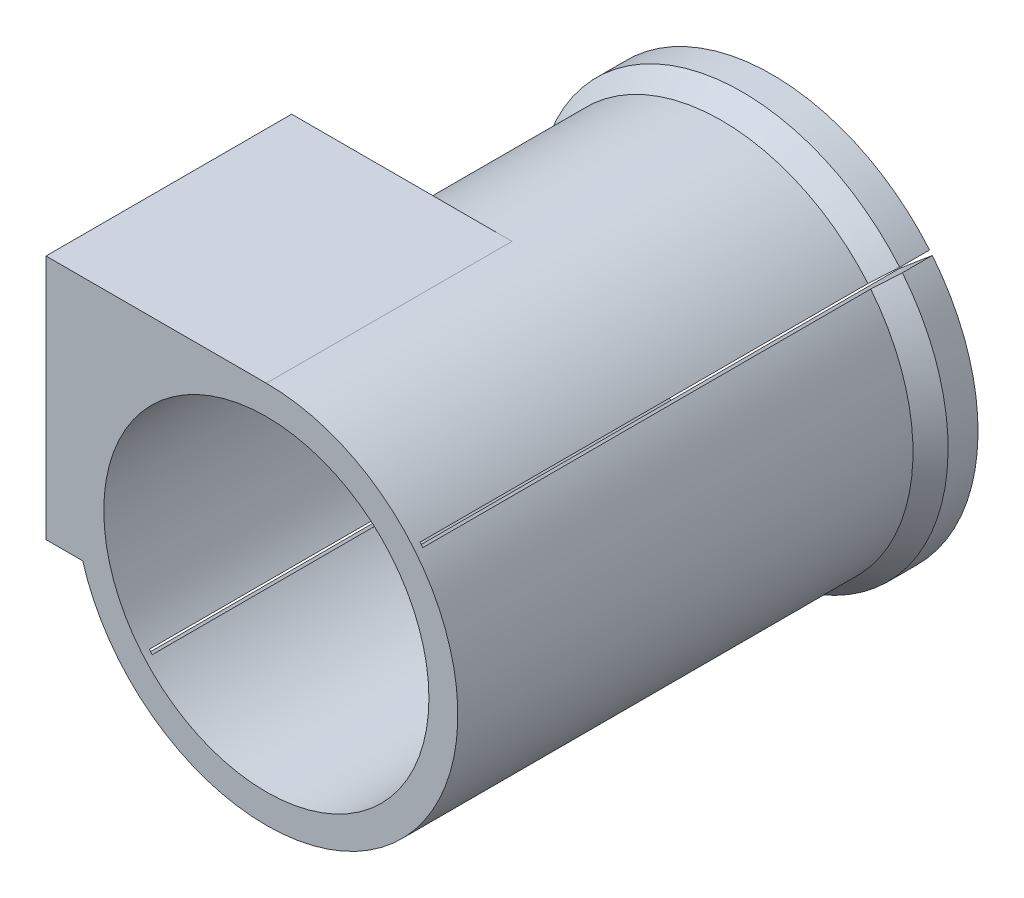
ISO-10303-21;
HEADER;
FILE_DESCRIPTION(('STEP AP214'),'2;1');
FILE_NAME('part.step','',(''),(''),'','','');
FILE_SCHEMA(('AUTOMOTIVE_DESIGN { 1 0 10303 214 1 1 1 1 }'));
ENDSEC;
DATA;
#1=APPLICATION_CONTEXT('core data for automotive mechanical design processes');
#2=APPLICATION_PROTOCOL_DEFINITION('international standard','automotive_design',2000,#1);
#3=PRODUCT_CONTEXT('',#1,'mechanical');
#4=PRODUCT('Part','Part','',(#3));
#5=PRODUCT_RELATED_PRODUCT_CATEGORY('part','',(#4));
#6=PRODUCT_DEFINITION_FORMATION('','',#4);
#7=PRODUCT_DEFINITION_CONTEXT('part definition',#1,'design');
#8=PRODUCT_DEFINITION('design','',#6,#7);
#9=PRODUCT_DEFINITION_SHAPE('','',#8);
#10=(LENGTH_UNIT() NAMED_UNIT(*) SI_UNIT(.MILLI.,.METRE.));
#11=(NAMED_UNIT(*) PLANE_ANGLE_UNIT() SI_UNIT($,.RADIAN.));
#12=(NAMED_UNIT(*) SI_UNIT($,.STERADIAN.) SOLID_ANGLE_UNIT());
#13=UNCERTAINTY_MEASURE_WITH_UNIT(LENGTH_MEASURE(1.E-05),#10,'distance_accuracy_value','');
#14=(GEOMETRIC_REPRESENTATION_CONTEXT(3) GLOBAL_UNCERTAINTY_ASSIGNED_CONTEXT((#13)) GLOBAL_UNIT_ASSIGNED_CONTEXT((#10,
#11,#12)) REPRESENTATION_CONTEXT('',''));
#15=CARTESIAN_POINT('',(0.,0.,0.));
#16=DIRECTION('',(0.,0.,1.));
#17=DIRECTION('',(1.,0.,0.));
#18=AXIS2_PLACEMENT_3D('',#15,#16,#17);
#19=CARTESIAN_POINT('',(0.,0.,0.));
#20=DIRECTION('',(0.,0.,1.));
#21=DIRECTION('',(1.,0.,0.));
#22=AXIS2_PLACEMENT_3D('',#19,#20,#21);
#23=PLANE('',#22);
#24=CARTESIAN_POINT('',(0.,0.,0.));
#25=DIRECTION('',(0.,0.,-1.));
#26=DIRECTION('',(-1.,0.,0.));
#27=AXIS2_PLACEMENT_3D('',#24,#25,#26);
#28=CIRCLE('',#27,14.25);
#29=CARTESIAN_POINT('',(-10.8967622003917,-9.18275958239758,0.));
#30=VERTEX_POINT('',#29);
#31=CARTESIAN_POINT('',(10.8967622003917,9.18275958239759,0.));
#32=VERTEX_POINT('',#31);
#33=EDGE_CURVE('E181',#30,#32,#28,.T.);
#34=ORIENTED_EDGE('',*,*,#33,.T.);
#35=DIRECTION('',(0.764685066694154,0.644404181220883,0.));
#36=VECTOR('',#35,1.);
#37=CARTESIAN_POINT('',(-20.9303446225494,-17.6381129652155,0.));
#38=LINE('',#37,#36);
#39=CARTESIAN_POINT('',(8.60270700030923,7.24954703873494,0.));
#40=VERTEX_POINT('',#39);
#41=EDGE_CURVE('E329',#40,#32,#38,.T.);
#42=ORIENTED_EDGE('',*,*,#41,.F.);
#43=CARTESIAN_POINT('',(0.,0.,0.));
#44=DIRECTION('',(0.,0.,1.));
#45=DIRECTION('',(1.,0.,0.));
#46=AXIS2_PLACEMENT_3D('',#43,#44,#45);
#47=CIRCLE('',#46,11.25);
#48=CARTESIAN_POINT('',(-8.60270700030924,-7.24954703873493,0.));
#49=VERTEX_POINT('',#48);
#50=EDGE_CURVE('E232',#40,#49,#47,.T.);
#51=ORIENTED_EDGE('',*,*,#50,.T.);
#52=EDGE_CURVE('E331',#30,#49,#38,.T.);
#53=ORIENTED_EDGE('',*,*,#52,.F.);
#54=EDGE_LOOP('',(#34,#42,#51,#53));
#55=FACE_BOUND('',#54,.T.);
#56=ADVANCED_FACE('F40',(#55),#23,.F.);
#57=CARTESIAN_POINT('',(0.,0.,2.));
#58=DIRECTION('',(0.,0.,-1.));
#59=DIRECTION('',(-1.,0.,0.));
#60=AXIS2_PLACEMENT_3D('',#57,#58,#59);
#61=CYLINDRICAL_SURFACE('',#60,14.25);
#62=DIRECTION('',(0.,0.,-1.));
#63=VECTOR('',#62,1.);
#64=CARTESIAN_POINT('',(10.8967622003917,9.18275958239759,2.));
#65=LINE('',#64,#63);
#66=CARTESIAN_POINT('',(10.8967622003917,9.18275958239759,2.07185199325792));
#67=VERTEX_POINT('',#66);
#68=EDGE_CURVE('E334',#32,#67,#65,.F.);
#69=ORIENTED_EDGE('',*,*,#68,.F.);
#70=ORIENTED_EDGE('',*,*,#33,.F.);
#71=DIRECTION('',(0.,0.,-1.));
#72=VECTOR('',#71,1.);
#73=CARTESIAN_POINT('',(-10.8967622003917,-9.18275958239758,2.));
#74=LINE('',#73,#72);
#75=CARTESIAN_POINT('',(-10.8967622003917,-9.18275958239758,2.07185199325792));
#76=VERTEX_POINT('',#75);
#77=EDGE_CURVE('E333',#76,#30,#74,.T.);
#78=ORIENTED_EDGE('',*,*,#77,.F.);
#79=CARTESIAN_POINT('',(0.,0.,2.07185199325792));
#80=DIRECTION('',(0.,0.,-1.));
#81=DIRECTION('',(-1.,0.,0.));
#82=AXIS2_PLACEMENT_3D('',#79,#80,#81);
#83=CIRCLE('',#82,14.25);
#84=EDGE_CURVE('E251',#76,#67,#83,.T.);
#85=ORIENTED_EDGE('',*,*,#84,.T.);
#86=EDGE_LOOP('',(#69,#70,#78,#85));
#87=FACE_BOUND('',#86,.T.);
#88=ADVANCED_FACE('F282',(#87),#61,.T.);
#89=CARTESIAN_POINT('',(0.,0.,35.));
#90=DIRECTION('',(0.,0.,-1.));
#91=DIRECTION('',(-1.,0.,0.));
#92=AXIS2_PLACEMENT_3D('',#89,#90,#91);
#93=CYLINDRICAL_SURFACE('',#92,13.25);
#94=DIRECTION('',(0.,0.,-1.));
#95=VECTOR('',#94,1.);
#96=CARTESIAN_POINT('',(10.1320771336975,8.53835540117671,35.));
#97=LINE('',#96,#95);
#98=CARTESIAN_POINT('',(10.1320771336975,8.5383554011767,34.5));
#99=VERTEX_POINT('',#98);
#100=CARTESIAN_POINT('',(10.1320771336975,8.53835540117671,3.50000000000001));
#101=VERTEX_POINT('',#100);
#102=EDGE_CURVE('E339',#99,#101,#97,.T.);
#103=ORIENTED_EDGE('',*,*,#102,.T.);
#104=CARTESIAN_POINT('',(0.,0.,3.50000000000001));
#105=DIRECTION('',(0.,0.,-1.));
#106=DIRECTION('',(-1.,0.,0.));
#107=AXIS2_PLACEMENT_3D('',#104,#105,#106);
#108=CIRCLE('',#107,13.25);
#109=CARTESIAN_POINT('',(-10.1320771336975,-8.5383554011767,3.50000000000001));
#110=VERTEX_POINT('',#109);
#111=EDGE_CURVE('E247',#101,#110,#108,.F.);
#112=ORIENTED_EDGE('',*,*,#111,.T.);
#113=DIRECTION('',(0.,0.,-1.));
#114=VECTOR('',#113,1.);
#115=CARTESIAN_POINT('',(-10.1320771336975,-8.5383554011767,35.));
#116=LINE('',#115,#114);
#117=CARTESIAN_POINT('',(-10.1320771336975,-8.5383554011767,34.5));
#118=VERTEX_POINT('',#117);
#119=EDGE_CURVE('E352',#110,#118,#116,.F.);
#120=ORIENTED_EDGE('',*,*,#119,.T.);
#121=CARTESIAN_POINT('',(0.,0.,34.5));
#122=DIRECTION('',(0.,0.,-1.));
#123=DIRECTION('',(-1.,0.,0.));
#124=AXIS2_PLACEMENT_3D('',#121,#122,#123);
#125=CIRCLE('',#124,13.25);
#126=CARTESIAN_POINT('',(-9.93615850278743,-8.76557209812829,34.5));
#127=VERTEX_POINT('',#126);
#128=EDGE_CURVE('E191',#127,#118,#125,.T.);
#129=ORIENTED_EDGE('',*,*,#128,.F.);
#130=DIRECTION('',(0.,0.,-1.));
#131=VECTOR('',#130,1.);
#132=CARTESIAN_POINT('',(-9.93615850278742,-8.76557209812829,35.));
#133=LINE('',#132,#131);
#134=CARTESIAN_POINT('',(-9.93615850278742,-8.76557209812829,3.50000000000001));
#135=VERTEX_POINT('',#134);
#136=EDGE_CURVE('E165',#127,#135,#133,.T.);
#137=ORIENTED_EDGE('',*,*,#136,.T.);
#138=CARTESIAN_POINT('',(0.,0.,3.50000000000001));
#139=DIRECTION('',(0.,0.,-1.));
#140=DIRECTION('',(-1.,0.,0.));
#141=AXIS2_PLACEMENT_3D('',#138,#139,#140);
#142=CIRCLE('',#141,13.25);
#143=CARTESIAN_POINT('',(10.32280101152,8.30676105811179,3.50000000000001));
#144=VERTEX_POINT('',#143);
#145=EDGE_CURVE('E243',#135,#144,#142,.F.);
#146=ORIENTED_EDGE('',*,*,#145,.T.);
#147=DIRECTION('',(0.,0.,-1.));
#148=VECTOR('',#147,1.);
#149=CARTESIAN_POINT('',(10.32280101152,8.30676105811179,35.));
#150=LINE('',#149,#148);
#151=CARTESIAN_POINT('',(10.32280101152,8.3067610581118,34.5));
#152=VERTEX_POINT('',#151);
#153=EDGE_CURVE('E164',#144,#152,#150,.F.);
#154=ORIENTED_EDGE('',*,*,#153,.T.);
#155=EDGE_CURVE('E188',#99,#152,#125,.T.);
#156=ORIENTED_EDGE('',*,*,#155,.F.);
#157=EDGE_LOOP('',(#103,#112,#120,#129,#137,#146,#154,#156));
#158=FACE_BOUND('',#157,.T.);
#159=DIRECTION('',(0.,0.,1.));
#160=VECTOR('',#159,1.);
#161=CARTESIAN_POINT('',(0.,13.25,18.));
#162=LINE('',#161,#160);
#163=CARTESIAN_POINT('',(0.,13.25,18.));
#164=VERTEX_POINT('',#163);
#165=CARTESIAN_POINT('',(0.,13.25,35.));
#166=VERTEX_POINT('',#165);
#167=EDGE_CURVE('E214',#164,#166,#162,.T.);
#168=ORIENTED_EDGE('',*,*,#167,.T.);
#169=CARTESIAN_POINT('',(0.,0.,35.));
#170=DIRECTION('',(0.,0.,1.));
#171=DIRECTION('',(1.,0.,0.));
#172=AXIS2_PLACEMENT_3D('',#169,#170,#171);
#173=CIRCLE('',#172,13.25);
#174=CARTESIAN_POINT('',(-12.7082650271388,-3.75,35.));
#175=VERTEX_POINT('',#174);
#176=EDGE_CURVE('E231',#175,#166,#173,.T.);
#177=ORIENTED_EDGE('',*,*,#176,.F.);
#178=DIRECTION('',(0.,0.,1.));
#179=VECTOR('',#178,1.);
#180=CARTESIAN_POINT('',(-12.7082650271388,-3.75,18.));
#181=LINE('',#180,#179);
#182=CARTESIAN_POINT('',(-12.7082650271388,-3.75,18.));
#183=VERTEX_POINT('',#182);
#184=EDGE_CURVE('E218',#183,#175,#181,.T.);
#185=ORIENTED_EDGE('',*,*,#184,.F.);
#186=CARTESIAN_POINT('',(0.,0.,18.));
#187=DIRECTION('',(0.,0.,1.));
#188=DIRECTION('',(1.,0.,0.));
#189=AXIS2_PLACEMENT_3D('',#186,#187,#188);
#190=CIRCLE('',#189,13.25);
#191=EDGE_CURVE('E205',#164,#183,#190,.T.);
#192=ORIENTED_EDGE('',*,*,#191,.F.);
#193=EDGE_LOOP('',(#168,#177,#185,#192));
#194=FACE_BOUND('',#193,.T.);
#195=ADVANCED_FACE('F305',(#158,#194),#93,.T.);
#196=CARTESIAN_POINT('',(0.,0.,35.));
#197=DIRECTION('',(0.,0.,1.));
#198=DIRECTION('',(1.,0.,0.));
#199=AXIS2_PLACEMENT_3D('',#196,#197,#198);
#200=PLANE('',#199);
#201=ORIENTED_EDGE('',*,*,#176,.T.);
#202=DIRECTION('',(1.,0.,0.));
#203=VECTOR('',#202,1.);
#204=CARTESIAN_POINT('',(0.,13.25,35.));
#205=LINE('',#204,#203);
#206=CARTESIAN_POINT('',(-15.25,13.25,35.));
#207=VERTEX_POINT('',#206);
#208=EDGE_CURVE('E180',#207,#166,#205,.T.);
#209=ORIENTED_EDGE('',*,*,#208,.F.);
#210=DIRECTION('',(0.,-1.,0.));
#211=VECTOR('',#210,1.);
#212=CARTESIAN_POINT('',(-15.25,0.,35.));
#213=LINE('',#212,#211);
#214=CARTESIAN_POINT('',(-15.25,-3.75,35.));
#215=VERTEX_POINT('',#214);
#216=EDGE_CURVE('E185',#207,#215,#213,.T.);
#217=ORIENTED_EDGE('',*,*,#216,.T.);
#218=DIRECTION('',(1.,0.,0.));
#219=VECTOR('',#218,1.);
#220=CARTESIAN_POINT('',(0.,-3.75,35.));
#221=LINE('',#220,#219);
#222=EDGE_CURVE('E197',#215,#175,#221,.T.);
#223=ORIENTED_EDGE('',*,*,#222,.T.);
#224=EDGE_LOOP('',(#201,#209,#217,#223));
#225=FACE_BOUND('',#224,.T.);
#226=CARTESIAN_POINT('',(0.,0.,35.));
#227=DIRECTION('',(0.,0.,1.));
#228=DIRECTION('',(1.,0.,0.));
#229=AXIS2_PLACEMENT_3D('',#226,#227,#228);
#230=CIRCLE('',#229,11.25);
#231=CARTESIAN_POINT('',(11.25,0.,35.));
#232=VERTEX_POINT('',#231);
#233=EDGE_CURVE('E227',#232,#232,#230,.T.);
#234=ORIENTED_EDGE('',*,*,#233,.F.);
#235=EDGE_LOOP('',(#234));
#236=FACE_BOUND('',#235,.T.);
#237=ADVANCED_FACE('F302',(#225,#236),#200,.T.);
#238=CARTESIAN_POINT('',(11.0876683921839,8.95131887628668,0.));
#239=VERTEX_POINT('',#238);
#240=CARTESIAN_POINT('',(-10.7010258834514,-9.41012991630318,0.));
#241=VERTEX_POINT('',#240);
#242=EDGE_CURVE('E172',#239,#241,#28,.T.);
#243=ORIENTED_EDGE('',*,*,#242,.T.);
#244=DIRECTION('',(-0.764685066694154,-0.644404181220883,0.));
#245=VECTOR('',#244,1.);
#246=CARTESIAN_POINT('',(21.1236658769157,17.4087074452073,0.));
#247=LINE('',#246,#245);
#248=CARTESIAN_POINT('',(-8.40632646170671,-7.47637448361232,0.));
#249=VERTEX_POINT('',#248);
#250=EDGE_CURVE('E176',#249,#241,#247,.T.);
#251=ORIENTED_EDGE('',*,*,#250,.F.);
#252=CARTESIAN_POINT('',(8.79296897043925,7.01756344359582,0.));
#253=VERTEX_POINT('',#252);
#254=EDGE_CURVE('E174',#249,#253,#47,.T.);
#255=ORIENTED_EDGE('',*,*,#254,.T.);
#256=EDGE_CURVE('E159',#239,#253,#247,.T.);
#257=ORIENTED_EDGE('',*,*,#256,.F.);
#258=EDGE_LOOP('',(#243,#251,#255,#257));
#259=FACE_BOUND('',#258,.T.);
#260=ADVANCED_FACE('F170',(#259),#23,.F.);
#261=CARTESIAN_POINT('',(0.,0.,35.));
#262=DIRECTION('',(0.,0.,-1.));
#263=DIRECTION('',(-1.,0.,0.));
#264=AXIS2_PLACEMENT_3D('',#261,#262,#263);
#265=CYLINDRICAL_SURFACE('',#264,11.25);
#266=DIRECTION('',(0.,0.,-1.));
#267=VECTOR('',#266,1.);
#268=CARTESIAN_POINT('',(8.60270700030923,7.24954703873494,35.));
#269=LINE('',#268,#267);
#270=CARTESIAN_POINT('',(8.60270700030923,7.24954703873494,34.5));
#271=VERTEX_POINT('',#270);
#272=EDGE_CURVE('E357',#271,#40,#269,.T.);
#273=ORIENTED_EDGE('',*,*,#272,.F.);
#274=CARTESIAN_POINT('',(0.,0.,34.5));
#275=DIRECTION('',(0.,0.,-1.));
#276=DIRECTION('',(-1.,0.,0.));
#277=AXIS2_PLACEMENT_3D('',#274,#275,#276);
#278=CIRCLE('',#277,11.25);
#279=CARTESIAN_POINT('',(8.79296897043925,7.01756344359583,34.5));
#280=VERTEX_POINT('',#279);
#281=EDGE_CURVE('E242',#271,#280,#278,.T.);
#282=ORIENTED_EDGE('',*,*,#281,.T.);
#283=DIRECTION('',(0.,0.,-1.));
#284=VECTOR('',#283,1.);
#285=CARTESIAN_POINT('',(8.79296897043925,7.01756344359582,35.));
#286=LINE('',#285,#284);
#287=EDGE_CURVE('E346',#253,#280,#286,.F.);
#288=ORIENTED_EDGE('',*,*,#287,.F.);
#289=ORIENTED_EDGE('',*,*,#254,.F.);
#290=DIRECTION('',(0.,0.,-1.));
#291=VECTOR('',#290,1.);
#292=CARTESIAN_POINT('',(-8.40632646170671,-7.47637448361232,35.));
#293=LINE('',#292,#291);
#294=CARTESIAN_POINT('',(-8.40632646170672,-7.47637448361232,34.5));
#295=VERTEX_POINT('',#294);
#296=EDGE_CURVE('E340',#295,#249,#293,.T.);
#297=ORIENTED_EDGE('',*,*,#296,.F.);
#298=CARTESIAN_POINT('',(-8.60270700030924,-7.24954703873493,34.5));
#299=VERTEX_POINT('',#298);
#300=EDGE_CURVE('E238',#295,#299,#278,.T.);
#301=ORIENTED_EDGE('',*,*,#300,.T.);
#302=DIRECTION('',(0.,0.,-1.));
#303=VECTOR('',#302,1.);
#304=CARTESIAN_POINT('',(-8.60270700030923,-7.24954703873493,35.));
#305=LINE('',#304,#303);
#306=EDGE_CURVE('E355',#49,#299,#305,.F.);
#307=ORIENTED_EDGE('',*,*,#306,.F.);
#308=ORIENTED_EDGE('',*,*,#50,.F.);
#309=EDGE_LOOP('',(#273,#282,#288,#289,#297,#301,#307,#308));
#310=FACE_BOUND('',#309,.T.);
#311=ORIENTED_EDGE('',*,*,#233,.T.);
#312=EDGE_LOOP('',(#311));
#313=FACE_BOUND('',#312,.T.);
#314=ADVANCED_FACE('F297',(#310,#313),#265,.F.);
#315=CARTESIAN_POINT('',(0.,13.25,18.));
#316=DIRECTION('',(0.,-1.,0.));
#317=DIRECTION('',(0.,0.,-1.));
#318=AXIS2_PLACEMENT_3D('',#315,#316,#317);
#319=PLANE('',#318);
#320=ORIENTED_EDGE('',*,*,#208,.T.);
#321=ORIENTED_EDGE('',*,*,#167,.F.);
#322=DIRECTION('',(1.,0.,0.));
#323=VECTOR('',#322,1.);
#324=CARTESIAN_POINT('',(0.,13.25,18.));
#325=LINE('',#324,#323);
#326=CARTESIAN_POINT('',(-15.25,13.25,18.));
#327=VERTEX_POINT('',#326);
#328=EDGE_CURVE('E193',#327,#164,#325,.T.);
#329=ORIENTED_EDGE('',*,*,#328,.F.);
#330=DIRECTION('',(0.,0.,1.));
#331=VECTOR('',#330,1.);
#332=CARTESIAN_POINT('',(-15.25,13.25,18.));
#333=LINE('',#332,#331);
#334=EDGE_CURVE('E207',#327,#207,#333,.T.);
#335=ORIENTED_EDGE('',*,*,#334,.T.);
#336=EDGE_LOOP('',(#320,#321,#329,#335));
#337=FACE_BOUND('',#336,.T.);
#338=ADVANCED_FACE('F290',(#337),#319,.F.);
#339=CARTESIAN_POINT('',(0.,-3.75,18.));
#340=DIRECTION('',(0.,-1.,0.));
#341=DIRECTION('',(0.,0.,-1.));
#342=AXIS2_PLACEMENT_3D('',#339,#340,#341);
#343=PLANE('',#342);
#344=ORIENTED_EDGE('',*,*,#222,.F.);
#345=DIRECTION('',(0.,0.,1.));
#346=VECTOR('',#345,1.);
#347=CARTESIAN_POINT('',(-15.25,-3.75,18.));
#348=LINE('',#347,#346);
#349=CARTESIAN_POINT('',(-15.25,-3.75,18.));
#350=VERTEX_POINT('',#349);
#351=EDGE_CURVE('E222',#350,#215,#348,.T.);
#352=ORIENTED_EDGE('',*,*,#351,.F.);
#353=DIRECTION('',(1.,0.,0.));
#354=VECTOR('',#353,1.);
#355=CARTESIAN_POINT('',(0.,-3.75,18.));
#356=LINE('',#355,#354);
#357=EDGE_CURVE('E201',#350,#183,#356,.T.);
#358=ORIENTED_EDGE('',*,*,#357,.T.);
#359=ORIENTED_EDGE('',*,*,#184,.T.);
#360=EDGE_LOOP('',(#344,#352,#358,#359));
#361=FACE_BOUND('',#360,.T.);
#362=ADVANCED_FACE('F287',(#361),#343,.T.);
#363=CARTESIAN_POINT('',(-15.25,0.,18.));
#364=DIRECTION('',(-1.,0.,0.));
#365=DIRECTION('',(0.,-1.,0.));
#366=AXIS2_PLACEMENT_3D('',#363,#364,#365);
#367=PLANE('',#366);
#368=ORIENTED_EDGE('',*,*,#216,.F.);
#369=ORIENTED_EDGE('',*,*,#334,.F.);
#370=DIRECTION('',(0.,-1.,0.));
#371=VECTOR('',#370,1.);
#372=CARTESIAN_POINT('',(-15.25,0.,18.));
#373=LINE('',#372,#371);
#374=EDGE_CURVE('E196',#327,#350,#373,.T.);
#375=ORIENTED_EDGE('',*,*,#374,.T.);
#376=ORIENTED_EDGE('',*,*,#351,.T.);
#377=EDGE_LOOP('',(#368,#369,#375,#376));
#378=FACE_BOUND('',#377,.T.);
#379=ADVANCED_FACE('F285',(#378),#367,.T.);
#380=CARTESIAN_POINT('',(0.,0.,18.));
#381=DIRECTION('',(0.,0.,1.));
#382=DIRECTION('',(1.,0.,0.));
#383=AXIS2_PLACEMENT_3D('',#380,#381,#382);
#384=PLANE('',#383);
#385=ORIENTED_EDGE('',*,*,#328,.T.);
#386=ORIENTED_EDGE('',*,*,#191,.T.);
#387=ORIENTED_EDGE('',*,*,#357,.F.);
#388=ORIENTED_EDGE('',*,*,#374,.F.);
#389=EDGE_LOOP('',(#385,#386,#387,#388));
#390=FACE_BOUND('',#389,.T.);
#391=ADVANCED_FACE('F281',(#390),#384,.F.);
#392=DIRECTION('',(0.,0.,-1.));
#393=VECTOR('',#392,1.);
#394=CARTESIAN_POINT('',(-10.7010258834514,-9.41012991630318,2.));
#395=LINE('',#394,#393);
#396=CARTESIAN_POINT('',(-10.7010258834514,-9.41012991630318,2.07185199325791));
#397=VERTEX_POINT('',#396);
#398=EDGE_CURVE('E70',#241,#397,#395,.F.);
#399=ORIENTED_EDGE('',*,*,#398,.F.);
#400=ORIENTED_EDGE('',*,*,#242,.F.);
#401=DIRECTION('',(0.,0.,-1.));
#402=VECTOR('',#401,1.);
#403=CARTESIAN_POINT('',(11.0876683921839,8.95131887628668,2.));
#404=LINE('',#403,#402);
#405=CARTESIAN_POINT('',(11.0876683921839,8.95131887628668,2.07185199325791));
#406=VERTEX_POINT('',#405);
#407=EDGE_CURVE('E62',#406,#239,#404,.T.);
#408=ORIENTED_EDGE('',*,*,#407,.F.);
#409=CARTESIAN_POINT('',(0.,0.,2.07185199325791));
#410=DIRECTION('',(0.,0.,-1.));
#411=DIRECTION('',(-1.,0.,0.));
#412=AXIS2_PLACEMENT_3D('',#409,#410,#411);
#413=CIRCLE('',#412,14.25);
#414=EDGE_CURVE('E262',#406,#397,#413,.T.);
#415=ORIENTED_EDGE('',*,*,#414,.T.);
#416=EDGE_LOOP('',(#399,#400,#408,#415));
#417=FACE_BOUND('',#416,.T.);
#418=ADVANCED_FACE('F178',(#417),#61,.T.);
#419=CARTESIAN_POINT('',(-20.9303446225494,-17.6381129652155,-55.0380746736615));
#420=DIRECTION('',(-0.644404181220883,0.764685066694154,0.));
#421=DIRECTION('',(-0.764685066694154,-0.644404181220883,0.));
#422=AXIS2_PLACEMENT_3D('',#419,#420,#421);
#423=PLANE('',#422);
#424=ORIENTED_EDGE('',*,*,#306,.T.);
#425=DIRECTION('',(-0.764685066694154,-0.644404181220883,0.));
#426=VECTOR('',#425,1.);
#427=CARTESIAN_POINT('',(-20.9303446225494,-17.6381129652155,34.5));
#428=LINE('',#427,#426);
#429=EDGE_CURVE('E384',#299,#118,#428,.T.);
#430=ORIENTED_EDGE('',*,*,#429,.T.);
#431=ORIENTED_EDGE('',*,*,#119,.F.);
#432=DIRECTION('',(0.438605335485299,0.369615053834391,0.819152044288988));
#433=VECTOR('',#432,1.);
#434=CARTESIAN_POINT('',(0.,0.,22.4229610893328));
#435=LINE('',#434,#433);
#436=EDGE_CURVE('E258',#110,#76,#435,.F.);
#437=ORIENTED_EDGE('',*,*,#436,.T.);
#438=ORIENTED_EDGE('',*,*,#77,.T.);
#439=ORIENTED_EDGE('',*,*,#52,.T.);
#440=EDGE_LOOP('',(#424,#430,#431,#437,#438,#439));
#441=FACE_BOUND('',#440,.T.);
#442=ADVANCED_FACE('F275',(#441),#423,.F.);
#443=CARTESIAN_POINT('',(21.1236658769157,17.4087074452073,-55.0380746736615));
#444=DIRECTION('',(0.644404181220883,-0.764685066694154,0.));
#445=DIRECTION('',(0.764685066694154,0.644404181220883,0.));
#446=AXIS2_PLACEMENT_3D('',#443,#444,#445);
#447=PLANE('',#446);
#448=ORIENTED_EDGE('',*,*,#296,.T.);
#449=ORIENTED_EDGE('',*,*,#250,.T.);
#450=ORIENTED_EDGE('',*,*,#398,.T.);
#451=CARTESIAN_POINT('',(-10.7010258834514,-9.41012991630318,2.07185199325791));
#452=CARTESIAN_POINT('',(-10.5735494698142,-9.30270486312418,2.30987801945504));
#453=CARTESIAN_POINT('',(-10.446072314607,-9.19527918502014,2.54790336644871));
#454=CARTESIAN_POINT('',(-10.1911165210524,-8.98042657896184,3.0239527020294));
#455=CARTESIAN_POINT('',(-10.0636378827049,-8.87299965100759,3.26197669061644));
#456=CARTESIAN_POINT('',(-9.93615850278743,-8.76557209812829,3.50000000000001));
#457=B_SPLINE_CURVE_WITH_KNOTS('',3,(#451,#452,#453,#454,#455,#456),.UNSPECIFIED.,.F.,.F.,(4,2,
4),(0.,0.871791778491614,1.74358355698428),.UNSPECIFIED.);
#458=EDGE_CURVE('E55',#397,#135,#457,.T.);
#459=ORIENTED_EDGE('',*,*,#458,.T.);
#460=ORIENTED_EDGE('',*,*,#136,.F.);
#461=DIRECTION('',(0.764685066694154,0.644404181220883,0.));
#462=VECTOR('',#461,1.);
#463=CARTESIAN_POINT('',(21.1236658769157,17.4087074452073,34.5));
#464=LINE('',#463,#462);
#465=EDGE_CURVE('E380',#127,#295,#464,.T.);
#466=ORIENTED_EDGE('',*,*,#465,.T.);
#467=EDGE_LOOP('',(#448,#449,#450,#459,#460,#466));
#468=FACE_BOUND('',#467,.T.);
#469=ADVANCED_FACE('F269',(#468),#447,.F.);
#470=CARTESIAN_POINT('',(0.,0.,34.5));
#471=DIRECTION('',(0.,0.,-1.));
#472=DIRECTION('',(-1.,0.,0.));
#473=AXIS2_PLACEMENT_3D('',#470,#471,#472);
#474=PLANE('',#473);
#475=ORIENTED_EDGE('',*,*,#128,.T.);
#476=ORIENTED_EDGE('',*,*,#429,.F.);
#477=ORIENTED_EDGE('',*,*,#300,.F.);
#478=ORIENTED_EDGE('',*,*,#465,.F.);
#479=EDGE_LOOP('',(#475,#476,#477,#478));
#480=FACE_BOUND('',#479,.T.);
#481=ADVANCED_FACE('F274',(#480),#474,.T.);
#482=ORIENTED_EDGE('',*,*,#155,.T.);
#483=EDGE_CURVE('E376',#280,#152,#464,.T.);
#484=ORIENTED_EDGE('',*,*,#483,.F.);
#485=ORIENTED_EDGE('',*,*,#281,.F.);
#486=EDGE_CURVE('E378',#99,#271,#428,.T.);
#487=ORIENTED_EDGE('',*,*,#486,.F.);
#488=EDGE_LOOP('',(#482,#484,#485,#487));
#489=FACE_BOUND('',#488,.T.);
#490=ADVANCED_FACE('F375',(#489),#474,.T.);
#491=ORIENTED_EDGE('',*,*,#272,.T.);
#492=ORIENTED_EDGE('',*,*,#41,.T.);
#493=ORIENTED_EDGE('',*,*,#68,.T.);
#494=DIRECTION('',(0.438605335485299,0.369615053834391,-0.819152044288988));
#495=VECTOR('',#494,1.);
#496=CARTESIAN_POINT('',(0.,0.,22.4229610893328));
#497=LINE('',#496,#495);
#498=EDGE_CURVE('E255',#67,#101,#497,.F.);
#499=ORIENTED_EDGE('',*,*,#498,.T.);
#500=ORIENTED_EDGE('',*,*,#102,.F.);
#501=ORIENTED_EDGE('',*,*,#486,.T.);
#502=EDGE_LOOP('',(#491,#492,#493,#499,#500,#501));
#503=FACE_BOUND('',#502,.T.);
#504=ADVANCED_FACE('F276',(#503),#423,.F.);
#505=ORIENTED_EDGE('',*,*,#287,.T.);
#506=ORIENTED_EDGE('',*,*,#483,.T.);
#507=ORIENTED_EDGE('',*,*,#153,.F.);
#508=CARTESIAN_POINT('',(10.32280101152,8.30676105811179,3.50000000000001));
#509=CARTESIAN_POINT('',(10.4502803914375,8.41418861099108,3.26197669061644));
#510=CARTESIAN_POINT('',(10.5777590297849,8.52161553894534,3.02395270202941));
#511=CARTESIAN_POINT('',(10.8327148233396,8.73646814500363,2.54790336644871));
#512=CARTESIAN_POINT('',(10.9601919785468,8.84389382310768,2.30987801945504));
#513=CARTESIAN_POINT('',(11.0876683921839,8.95131887628668,2.07185199325791));
#514=B_SPLINE_CURVE_WITH_KNOTS('',3,(#508,#509,#510,#511,#512,#513),.UNSPECIFIED.,.F.,.F.,(4,2,
4),(0.,0.871791778492668,1.74358355698428),.UNSPECIFIED.);
#515=EDGE_CURVE('E11',#144,#406,#514,.T.);
#516=ORIENTED_EDGE('',*,*,#515,.T.);
#517=ORIENTED_EDGE('',*,*,#407,.T.);
#518=ORIENTED_EDGE('',*,*,#256,.T.);
#519=EDGE_LOOP('',(#505,#506,#507,#516,#517,#518));
#520=FACE_BOUND('',#519,.T.);
#521=ADVANCED_FACE('F158',(#520),#447,.F.);
#522=CARTESIAN_POINT('',(0.,0.,2.));
#523=DIRECTION('',(0.,0.,-1.));
#524=DIRECTION('',(-1.,0.,0.));
#525=AXIS2_PLACEMENT_3D('',#522,#523,#524);
#526=CONICAL_SURFACE('',#525,14.3003113073146,0.610865238198022);
#527=ORIENTED_EDGE('',*,*,#436,.F.);
#528=ORIENTED_EDGE('',*,*,#111,.F.);
#529=ORIENTED_EDGE('',*,*,#498,.F.);
#530=ORIENTED_EDGE('',*,*,#84,.F.);
#531=EDGE_LOOP('',(#527,#528,#529,#530));
#532=FACE_BOUND('',#531,.T.);
#533=ADVANCED_FACE('F311',(#532),#526,.T.);
#534=CARTESIAN_POINT('',(0.,0.,2.));
#535=DIRECTION('',(0.,0.,-1.));
#536=DIRECTION('',(-1.,0.,0.));
#537=AXIS2_PLACEMENT_3D('',#534,#535,#536);
#538=CONICAL_SURFACE('',#537,14.3003113073146,0.610865238198021);
#539=ORIENTED_EDGE('',*,*,#515,.F.);
#540=ORIENTED_EDGE('',*,*,#145,.F.);
#541=ORIENTED_EDGE('',*,*,#458,.F.);
#542=ORIENTED_EDGE('',*,*,#414,.F.);
#543=EDGE_LOOP('',(#539,#540,#541,#542));
#544=FACE_BOUND('',#543,.T.);
#545=ADVANCED_FACE('F42',(#544),#538,.T.);
#546=CLOSED_SHELL('',(#56,#88,#195,#237,#260,#314,#338,#362,#379,#391,#418,#442,#469,#481,#490,
#504,#521,#533,#545));
#547=MANIFOLD_SOLID_BREP('B2',#546);
#548=ADVANCED_BREP_SHAPE_REPRESENTATION('',(#18,#547),#14);
#549=SHAPE_DEFINITION_REPRESENTATION(#9,#548);
ENDSEC;
END-ISO-10303-21;
